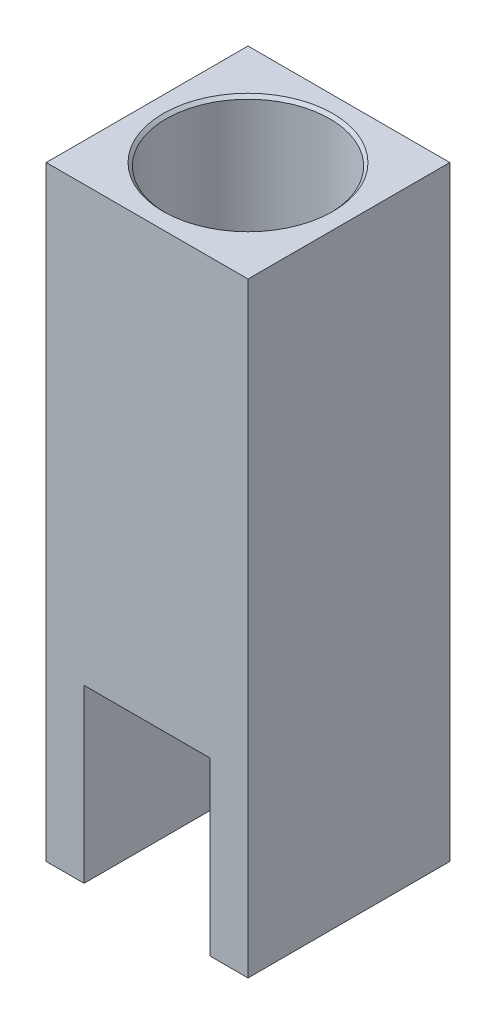
ISO-10303-21;
HEADER;
FILE_DESCRIPTION(('STEP AP214'),'2;1');
FILE_NAME('part.step','',(''),(''),'','','');
FILE_SCHEMA(('AUTOMOTIVE_DESIGN { 1 0 10303 214 1 1 1 1 }'));
ENDSEC;
DATA;
#1=APPLICATION_CONTEXT('core data for automotive mechanical design processes');
#2=APPLICATION_PROTOCOL_DEFINITION('international standard','automotive_design',2000,#1);
#3=PRODUCT_CONTEXT('',#1,'mechanical');
#4=PRODUCT('Part','Part','',(#3));
#5=PRODUCT_RELATED_PRODUCT_CATEGORY('part','',(#4));
#6=PRODUCT_DEFINITION_FORMATION('','',#4);
#7=PRODUCT_DEFINITION_CONTEXT('part definition',#1,'design');
#8=PRODUCT_DEFINITION('design','',#6,#7);
#9=PRODUCT_DEFINITION_SHAPE('','',#8);
#10=(LENGTH_UNIT() NAMED_UNIT(*) SI_UNIT(.MILLI.,.METRE.));
#11=(NAMED_UNIT(*) PLANE_ANGLE_UNIT() SI_UNIT($,.RADIAN.));
#12=(NAMED_UNIT(*) SI_UNIT($,.STERADIAN.) SOLID_ANGLE_UNIT());
#13=UNCERTAINTY_MEASURE_WITH_UNIT(LENGTH_MEASURE(1.E-05),#10,'distance_accuracy_value','');
#14=(GEOMETRIC_REPRESENTATION_CONTEXT(3) GLOBAL_UNCERTAINTY_ASSIGNED_CONTEXT((#13)) GLOBAL_UNIT_ASSIGNED_CONTEXT((#10,
#11,#12)) REPRESENTATION_CONTEXT('',''));
#15=CARTESIAN_POINT('',(0.,0.,0.));
#16=DIRECTION('',(0.,0.,1.));
#17=DIRECTION('',(1.,0.,0.));
#18=AXIS2_PLACEMENT_3D('',#15,#16,#17);
#19=CARTESIAN_POINT('',(25.4,0.,25.4));
#20=DIRECTION('',(0.,1.,0.));
#21=DIRECTION('',(0.,0.,1.));
#22=AXIS2_PLACEMENT_3D('',#19,#20,#21);
#23=CYLINDRICAL_SURFACE('',#22,6.1468);
#24=CARTESIAN_POINT('',(25.4,69.85,25.4));
#25=DIRECTION('',(0.,1.,0.));
#26=DIRECTION('',(0.,0.,1.));
#27=AXIS2_PLACEMENT_3D('',#24,#25,#26);
#28=CIRCLE('',#27,6.1468);
#29=CARTESIAN_POINT('',(25.4,69.85,31.5468));
#30=VERTEX_POINT('',#29);
#31=EDGE_CURVE('E178',#30,#30,#28,.F.);
#32=ORIENTED_EDGE('',*,*,#31,.F.);
#33=EDGE_LOOP('',(#32));
#34=FACE_BOUND('',#33,.T.);
#35=CARTESIAN_POINT('',(25.4,47.498,25.4));
#36=DIRECTION('',(0.,-1.,0.));
#37=DIRECTION('',(0.,0.,-1.));
#38=AXIS2_PLACEMENT_3D('',#35,#36,#37);
#39=CIRCLE('',#38,6.1468);
#40=CARTESIAN_POINT('',(25.4,47.498,19.2532));
#41=VERTEX_POINT('',#40);
#42=EDGE_CURVE('E144',#41,#41,#39,.F.);
#43=ORIENTED_EDGE('',*,*,#42,.F.);
#44=EDGE_LOOP('',(#43));
#45=FACE_BOUND('',#44,.T.);
#46=ADVANCED_FACE('F38',(#34,#45),#23,.F.);
#47=CARTESIAN_POINT('',(0.,152.4,0.));
#48=DIRECTION('',(1.,0.,0.));
#49=DIRECTION('',(0.,0.,-1.));
#50=AXIS2_PLACEMENT_3D('',#47,#48,#49);
#51=PLANE('',#50);
#52=DIRECTION('',(0.,0.,1.));
#53=VECTOR('',#52,1.);
#54=CARTESIAN_POINT('',(0.,0.,0.));
#55=LINE('',#54,#53);
#56=CARTESIAN_POINT('',(0.,0.,0.));
#57=VERTEX_POINT('',#56);
#58=CARTESIAN_POINT('',(0.,0.,50.8));
#59=VERTEX_POINT('',#58);
#60=EDGE_CURVE('E177',#57,#59,#55,.T.);
#61=ORIENTED_EDGE('',*,*,#60,.T.);
#62=DIRECTION('',(0.,-1.,0.));
#63=VECTOR('',#62,1.);
#64=CARTESIAN_POINT('',(0.,152.4,50.8));
#65=LINE('',#64,#63);
#66=CARTESIAN_POINT('',(0.,152.4,50.8));
#67=VERTEX_POINT('',#66);
#68=EDGE_CURVE('E207',#67,#59,#65,.T.);
#69=ORIENTED_EDGE('',*,*,#68,.F.);
#70=DIRECTION('',(0.,0.,1.));
#71=VECTOR('',#70,1.);
#72=CARTESIAN_POINT('',(0.,152.4,0.));
#73=LINE('',#72,#71);
#74=CARTESIAN_POINT('',(0.,152.4,0.));
#75=VERTEX_POINT('',#74);
#76=EDGE_CURVE('E179',#75,#67,#73,.T.);
#77=ORIENTED_EDGE('',*,*,#76,.F.);
#78=DIRECTION('',(0.,-1.,0.));
#79=VECTOR('',#78,1.);
#80=CARTESIAN_POINT('',(0.,152.4,0.));
#81=LINE('',#80,#79);
#82=EDGE_CURVE('E189',#75,#57,#81,.T.);
#83=ORIENTED_EDGE('',*,*,#82,.T.);
#84=EDGE_LOOP('',(#61,#69,#77,#83));
#85=FACE_BOUND('',#84,.T.);
#86=ADVANCED_FACE('F245',(#85),#51,.F.);
#87=CARTESIAN_POINT('',(0.,152.4,50.8));
#88=DIRECTION('',(0.,0.,-1.));
#89=DIRECTION('',(-1.,0.,0.));
#90=AXIS2_PLACEMENT_3D('',#87,#88,#89);
#91=PLANE('',#90);
#92=DIRECTION('',(1.,0.,0.));
#93=VECTOR('',#92,1.);
#94=CARTESIAN_POINT('',(0.,0.,50.8));
#95=LINE('',#94,#93);
#96=CARTESIAN_POINT('',(9.52500000000001,0.,50.8));
#97=VERTEX_POINT('',#96);
#98=EDGE_CURVE('E193',#59,#97,#95,.T.);
#99=ORIENTED_EDGE('',*,*,#98,.T.);
#100=DIRECTION('',(0.,-1.,0.));
#101=VECTOR('',#100,1.);
#102=CARTESIAN_POINT('',(9.52500000000001,0.,50.8));
#103=LINE('',#102,#101);
#104=CARTESIAN_POINT('',(9.52500000000001,43.18,50.8));
#105=VERTEX_POINT('',#104);
#106=EDGE_CURVE('E151',#105,#97,#103,.T.);
#107=ORIENTED_EDGE('',*,*,#106,.F.);
#108=DIRECTION('',(-1.,0.,0.));
#109=VECTOR('',#108,1.);
#110=CARTESIAN_POINT('',(9.52500000000001,43.18,50.8));
#111=LINE('',#110,#109);
#112=CARTESIAN_POINT('',(41.275,43.18,50.8));
#113=VERTEX_POINT('',#112);
#114=EDGE_CURVE('E158',#113,#105,#111,.T.);
#115=ORIENTED_EDGE('',*,*,#114,.F.);
#116=DIRECTION('',(0.,1.,0.));
#117=VECTOR('',#116,1.);
#118=CARTESIAN_POINT('',(41.275,43.18,50.8));
#119=LINE('',#118,#117);
#120=CARTESIAN_POINT('',(41.275,0.,50.8));
#121=VERTEX_POINT('',#120);
#122=EDGE_CURVE('E155',#121,#113,#119,.T.);
#123=ORIENTED_EDGE('',*,*,#122,.F.);
#124=CARTESIAN_POINT('',(50.8,0.,50.8));
#125=VERTEX_POINT('',#124);
#126=EDGE_CURVE('E192',#121,#125,#95,.T.);
#127=ORIENTED_EDGE('',*,*,#126,.T.);
#128=DIRECTION('',(0.,-1.,0.));
#129=VECTOR('',#128,1.);
#130=CARTESIAN_POINT('',(50.8,152.4,50.8));
#131=LINE('',#130,#129);
#132=CARTESIAN_POINT('',(50.8,152.4,50.8));
#133=VERTEX_POINT('',#132);
#134=EDGE_CURVE('E204',#133,#125,#131,.T.);
#135=ORIENTED_EDGE('',*,*,#134,.F.);
#136=DIRECTION('',(1.,0.,0.));
#137=VECTOR('',#136,1.);
#138=CARTESIAN_POINT('',(0.,152.4,50.8));
#139=LINE('',#138,#137);
#140=EDGE_CURVE('E182',#67,#133,#139,.T.);
#141=ORIENTED_EDGE('',*,*,#140,.F.);
#142=ORIENTED_EDGE('',*,*,#68,.T.);
#143=EDGE_LOOP('',(#99,#107,#115,#123,#127,#135,#141,#142));
#144=FACE_BOUND('',#143,.T.);
#145=ADVANCED_FACE('F251',(#144),#91,.F.);
#146=CARTESIAN_POINT('',(50.8,152.4,0.));
#147=DIRECTION('',(-1.,0.,0.));
#148=DIRECTION('',(0.,0.,1.));
#149=AXIS2_PLACEMENT_3D('',#146,#147,#148);
#150=PLANE('',#149);
#151=DIRECTION('',(0.,0.,-1.));
#152=VECTOR('',#151,1.);
#153=CARTESIAN_POINT('',(50.8,0.,0.));
#154=LINE('',#153,#152);
#155=CARTESIAN_POINT('',(50.8,0.,0.));
#156=VERTEX_POINT('',#155);
#157=EDGE_CURVE('E196',#125,#156,#154,.T.);
#158=ORIENTED_EDGE('',*,*,#157,.T.);
#159=DIRECTION('',(0.,-1.,0.));
#160=VECTOR('',#159,1.);
#161=CARTESIAN_POINT('',(50.8,152.4,0.));
#162=LINE('',#161,#160);
#163=CARTESIAN_POINT('',(50.8,152.4,0.));
#164=VERTEX_POINT('',#163);
#165=EDGE_CURVE('E201',#164,#156,#162,.T.);
#166=ORIENTED_EDGE('',*,*,#165,.F.);
#167=DIRECTION('',(0.,0.,-1.));
#168=VECTOR('',#167,1.);
#169=CARTESIAN_POINT('',(50.8,152.4,0.));
#170=LINE('',#169,#168);
#171=EDGE_CURVE('E185',#133,#164,#170,.T.);
#172=ORIENTED_EDGE('',*,*,#171,.F.);
#173=ORIENTED_EDGE('',*,*,#134,.T.);
#174=EDGE_LOOP('',(#158,#166,#172,#173));
#175=FACE_BOUND('',#174,.T.);
#176=ADVANCED_FACE('F271',(#175),#150,.F.);
#177=CARTESIAN_POINT('',(0.,152.4,0.));
#178=DIRECTION('',(0.,0.,1.));
#179=DIRECTION('',(1.,0.,0.));
#180=AXIS2_PLACEMENT_3D('',#177,#178,#179);
#181=PLANE('',#180);
#182=DIRECTION('',(-1.,0.,0.));
#183=VECTOR('',#182,1.);
#184=CARTESIAN_POINT('',(0.,0.,0.));
#185=LINE('',#184,#183);
#186=EDGE_CURVE('E183',#156,#57,#185,.T.);
#187=ORIENTED_EDGE('',*,*,#186,.T.);
#188=ORIENTED_EDGE('',*,*,#82,.F.);
#189=DIRECTION('',(-1.,0.,0.));
#190=VECTOR('',#189,1.);
#191=CARTESIAN_POINT('',(0.,152.4,0.));
#192=LINE('',#191,#190);
#193=EDGE_CURVE('E187',#164,#75,#192,.T.);
#194=ORIENTED_EDGE('',*,*,#193,.F.);
#195=ORIENTED_EDGE('',*,*,#165,.T.);
#196=EDGE_LOOP('',(#187,#188,#194,#195));
#197=FACE_BOUND('',#196,.T.);
#198=ADVANCED_FACE('F263',(#197),#181,.F.);
#199=CARTESIAN_POINT('',(0.,152.4,0.));
#200=DIRECTION('',(0.,1.,0.));
#201=DIRECTION('',(0.,0.,1.));
#202=AXIS2_PLACEMENT_3D('',#199,#200,#201);
#203=PLANE('',#202);
#204=CARTESIAN_POINT('',(25.4,152.4,25.4));
#205=DIRECTION('',(0.,1.,0.));
#206=DIRECTION('',(0.,0.,1.));
#207=AXIS2_PLACEMENT_3D('',#204,#205,#206);
#208=CIRCLE('',#207,21.3614);
#209=CARTESIAN_POINT('',(25.4,152.4,46.7614));
#210=VERTEX_POINT('',#209);
#211=EDGE_CURVE('E11',#210,#210,#208,.F.);
#212=ORIENTED_EDGE('',*,*,#211,.T.);
#213=EDGE_LOOP('',(#212));
#214=FACE_BOUND('',#213,.T.);
#215=ORIENTED_EDGE('',*,*,#76,.T.);
#216=ORIENTED_EDGE('',*,*,#140,.T.);
#217=ORIENTED_EDGE('',*,*,#171,.T.);
#218=ORIENTED_EDGE('',*,*,#193,.T.);
#219=EDGE_LOOP('',(#215,#216,#217,#218));
#220=FACE_BOUND('',#219,.T.);
#221=ADVANCED_FACE('F259',(#214,#220),#203,.T.);
#222=CARTESIAN_POINT('',(0.,0.,0.));
#223=DIRECTION('',(0.,1.,0.));
#224=DIRECTION('',(0.,0.,1.));
#225=AXIS2_PLACEMENT_3D('',#222,#223,#224);
#226=PLANE('',#225);
#227=CARTESIAN_POINT('',(6.35,0.,6.35));
#228=DIRECTION('',(0.,-1.,0.));
#229=DIRECTION('',(0.,0.,-1.));
#230=AXIS2_PLACEMENT_3D('',#227,#228,#229);
#231=CIRCLE('',#230,1.89864999999999);
#232=CARTESIAN_POINT('',(6.35,0.,4.45135000000001));
#233=VERTEX_POINT('',#232);
#234=EDGE_CURVE('E130',#233,#233,#231,.T.);
#235=ORIENTED_EDGE('',*,*,#234,.F.);
#236=EDGE_LOOP('',(#235));
#237=FACE_BOUND('',#236,.T.);
#238=CARTESIAN_POINT('',(44.45,0.,6.35000000000001));
#239=DIRECTION('',(0.,-1.,0.));
#240=DIRECTION('',(0.,0.,-1.));
#241=AXIS2_PLACEMENT_3D('',#238,#239,#240);
#242=CIRCLE('',#241,1.89864999999999);
#243=CARTESIAN_POINT('',(44.45,0.,4.45135000000002));
#244=VERTEX_POINT('',#243);
#245=EDGE_CURVE('E129',#244,#244,#242,.T.);
#246=ORIENTED_EDGE('',*,*,#245,.F.);
#247=EDGE_LOOP('',(#246));
#248=FACE_BOUND('',#247,.T.);
#249=DIRECTION('',(1.,0.,0.));
#250=VECTOR('',#249,1.);
#251=CARTESIAN_POINT('',(41.275,0.,8.3566));
#252=LINE('',#251,#250);
#253=CARTESIAN_POINT('',(15.875,0.,8.3566));
#254=VERTEX_POINT('',#253);
#255=CARTESIAN_POINT('',(34.925,0.,8.3566));
#256=VERTEX_POINT('',#255);
#257=EDGE_CURVE('E147',#254,#256,#252,.T.);
#258=ORIENTED_EDGE('',*,*,#257,.F.);
#259=CARTESIAN_POINT('',(15.875,0.,14.7066));
#260=DIRECTION('',(0.,1.,0.));
#261=DIRECTION('',(0.,0.,1.));
#262=AXIS2_PLACEMENT_3D('',#259,#260,#261);
#263=CIRCLE('',#262,6.35);
#264=CARTESIAN_POINT('',(9.52500000000001,0.,14.7066));
#265=VERTEX_POINT('',#264);
#266=EDGE_CURVE('E228',#254,#265,#263,.T.);
#267=ORIENTED_EDGE('',*,*,#266,.T.);
#268=DIRECTION('',(0.,0.,1.));
#269=VECTOR('',#268,1.);
#270=CARTESIAN_POINT('',(9.52500000000001,0.,8.3566));
#271=LINE('',#270,#269);
#272=EDGE_CURVE('E163',#265,#97,#271,.T.);
#273=ORIENTED_EDGE('',*,*,#272,.T.);
#274=ORIENTED_EDGE('',*,*,#98,.F.);
#275=ORIENTED_EDGE('',*,*,#60,.F.);
#276=ORIENTED_EDGE('',*,*,#186,.F.);
#277=ORIENTED_EDGE('',*,*,#157,.F.);
#278=ORIENTED_EDGE('',*,*,#126,.F.);
#279=DIRECTION('',(0.,0.,1.));
#280=VECTOR('',#279,1.);
#281=CARTESIAN_POINT('',(41.275,0.,8.3566));
#282=LINE('',#281,#280);
#283=CARTESIAN_POINT('',(41.275,0.,14.7066));
#284=VERTEX_POINT('',#283);
#285=EDGE_CURVE('E154',#284,#121,#282,.T.);
#286=ORIENTED_EDGE('',*,*,#285,.F.);
#287=CARTESIAN_POINT('',(34.925,0.,14.7066));
#288=DIRECTION('',(0.,1.,0.));
#289=DIRECTION('',(0.,0.,1.));
#290=AXIS2_PLACEMENT_3D('',#287,#288,#289);
#291=CIRCLE('',#290,6.35);
#292=EDGE_CURVE('E230',#284,#256,#291,.T.);
#293=ORIENTED_EDGE('',*,*,#292,.T.);
#294=EDGE_LOOP('',(#258,#267,#273,#274,#275,#276,#277,#278,#286,#293));
#295=FACE_BOUND('',#294,.T.);
#296=ADVANCED_FACE('F262',(#237,#248,#295),#226,.F.);
#297=CARTESIAN_POINT('',(25.4,77.47,25.4));
#298=DIRECTION('',(0.,1.,0.));
#299=DIRECTION('',(0.,0.,1.));
#300=AXIS2_PLACEMENT_3D('',#297,#298,#299);
#301=PLANE('',#300);
#302=CARTESIAN_POINT('',(25.4,77.47,25.4));
#303=DIRECTION('',(0.,1.,0.));
#304=DIRECTION('',(0.,0.,1.));
#305=AXIS2_PLACEMENT_3D('',#302,#303,#304);
#306=CIRCLE('',#305,17.78);
#307=CARTESIAN_POINT('',(25.4,77.47,43.18));
#308=VERTEX_POINT('',#307);
#309=EDGE_CURVE('E173',#308,#308,#306,.T.);
#310=ORIENTED_EDGE('',*,*,#309,.F.);
#311=EDGE_LOOP('',(#310));
#312=FACE_BOUND('',#311,.T.);
#313=CARTESIAN_POINT('',(25.4,77.47,25.4));
#314=DIRECTION('',(0.,1.,0.));
#315=DIRECTION('',(0.,0.,1.));
#316=AXIS2_PLACEMENT_3D('',#313,#314,#315);
#317=CIRCLE('',#316,20.5994);
#318=CARTESIAN_POINT('',(25.4,77.47,45.9994));
#319=VERTEX_POINT('',#318);
#320=EDGE_CURVE('E174',#319,#319,#317,.T.);
#321=ORIENTED_EDGE('',*,*,#320,.T.);
#322=EDGE_LOOP('',(#321));
#323=FACE_BOUND('',#322,.T.);
#324=ADVANCED_FACE('F267',(#312,#323),#301,.T.);
#325=CARTESIAN_POINT('',(25.4,77.47,25.4));
#326=DIRECTION('',(0.,1.,0.));
#327=DIRECTION('',(0.,0.,1.));
#328=AXIS2_PLACEMENT_3D('',#325,#326,#327);
#329=CYLINDRICAL_SURFACE('',#328,20.5994);
#330=CARTESIAN_POINT('',(25.4,151.638,25.4));
#331=DIRECTION('',(0.,1.,0.));
#332=DIRECTION('',(0.,0.,1.));
#333=AXIS2_PLACEMENT_3D('',#330,#331,#332);
#334=CIRCLE('',#333,20.5994);
#335=CARTESIAN_POINT('',(25.4,151.638,45.9994));
#336=VERTEX_POINT('',#335);
#337=EDGE_CURVE('E46',#336,#336,#334,.T.);
#338=ORIENTED_EDGE('',*,*,#337,.T.);
#339=EDGE_LOOP('',(#338));
#340=FACE_BOUND('',#339,.T.);
#341=ORIENTED_EDGE('',*,*,#320,.F.);
#342=EDGE_LOOP('',(#341));
#343=FACE_BOUND('',#342,.T.);
#344=ADVANCED_FACE('F234',(#340,#343),#329,.F.);
#345=CARTESIAN_POINT('',(25.4,69.85,25.4));
#346=DIRECTION('',(0.,1.,0.));
#347=DIRECTION('',(0.,0.,1.));
#348=AXIS2_PLACEMENT_3D('',#345,#346,#347);
#349=PLANE('',#348);
#350=CARTESIAN_POINT('',(25.4,69.85,25.4));
#351=DIRECTION('',(0.,1.,0.));
#352=DIRECTION('',(0.,0.,1.));
#353=AXIS2_PLACEMENT_3D('',#350,#351,#352);
#354=CIRCLE('',#353,17.78);
#355=CARTESIAN_POINT('',(25.4,69.85,43.18));
#356=VERTEX_POINT('',#355);
#357=EDGE_CURVE('E165',#356,#356,#354,.T.);
#358=ORIENTED_EDGE('',*,*,#357,.T.);
#359=EDGE_LOOP('',(#358));
#360=FACE_BOUND('',#359,.T.);
#361=ORIENTED_EDGE('',*,*,#31,.T.);
#362=EDGE_LOOP('',(#361));
#363=FACE_BOUND('',#362,.T.);
#364=ADVANCED_FACE('F330',(#360,#363),#349,.T.);
#365=CARTESIAN_POINT('',(25.4,69.85,25.4));
#366=DIRECTION('',(0.,1.,0.));
#367=DIRECTION('',(0.,0.,1.));
#368=AXIS2_PLACEMENT_3D('',#365,#366,#367);
#369=CYLINDRICAL_SURFACE('',#368,17.78);
#370=ORIENTED_EDGE('',*,*,#309,.T.);
#371=EDGE_LOOP('',(#370));
#372=FACE_BOUND('',#371,.T.);
#373=ORIENTED_EDGE('',*,*,#357,.F.);
#374=EDGE_LOOP('',(#373));
#375=FACE_BOUND('',#374,.T.);
#376=ADVANCED_FACE('F322',(#372,#375),#369,.F.);
#377=CARTESIAN_POINT('',(9.52500000000001,43.18,8.3566));
#378=DIRECTION('',(0.,1.,0.));
#379=DIRECTION('',(0.,0.,1.));
#380=AXIS2_PLACEMENT_3D('',#377,#378,#379);
#381=PLANE('',#380);
#382=CARTESIAN_POINT('',(25.4,43.18,25.4));
#383=DIRECTION('',(0.,-1.,0.));
#384=DIRECTION('',(0.,0.,-1.));
#385=AXIS2_PLACEMENT_3D('',#382,#383,#384);
#386=CIRCLE('',#385,9.144);
#387=CARTESIAN_POINT('',(25.4,43.18,16.256));
#388=VERTEX_POINT('',#387);
#389=EDGE_CURVE('E140',#388,#388,#386,.T.);
#390=ORIENTED_EDGE('',*,*,#389,.F.);
#391=EDGE_LOOP('',(#390));
#392=FACE_BOUND('',#391,.T.);
#393=DIRECTION('',(0.,0.,1.));
#394=VECTOR('',#393,1.);
#395=CARTESIAN_POINT('',(9.52500000000001,43.18,8.3566));
#396=LINE('',#395,#394);
#397=CARTESIAN_POINT('',(9.52500000000001,43.18,14.7066));
#398=VERTEX_POINT('',#397);
#399=EDGE_CURVE('E166',#398,#105,#396,.T.);
#400=ORIENTED_EDGE('',*,*,#399,.F.);
#401=CARTESIAN_POINT('',(15.875,43.18,14.7066));
#402=DIRECTION('',(0.,1.,0.));
#403=DIRECTION('',(0.,0.,1.));
#404=AXIS2_PLACEMENT_3D('',#401,#402,#403);
#405=CIRCLE('',#404,6.35);
#406=CARTESIAN_POINT('',(15.875,43.18,8.3566));
#407=VERTEX_POINT('',#406);
#408=EDGE_CURVE('E225',#398,#407,#405,.F.);
#409=ORIENTED_EDGE('',*,*,#408,.T.);
#410=DIRECTION('',(-1.,0.,0.));
#411=VECTOR('',#410,1.);
#412=CARTESIAN_POINT('',(34.925,43.18,8.3566));
#413=LINE('',#412,#411);
#414=CARTESIAN_POINT('',(34.925,43.18,8.3566));
#415=VERTEX_POINT('',#414);
#416=EDGE_CURVE('E150',#415,#407,#413,.T.);
#417=ORIENTED_EDGE('',*,*,#416,.F.);
#418=CARTESIAN_POINT('',(34.925,43.18,14.7066));
#419=DIRECTION('',(0.,1.,0.));
#420=DIRECTION('',(0.,0.,1.));
#421=AXIS2_PLACEMENT_3D('',#418,#419,#420);
#422=CIRCLE('',#421,6.35);
#423=CARTESIAN_POINT('',(41.275,43.18,14.7066));
#424=VERTEX_POINT('',#423);
#425=EDGE_CURVE('E61',#415,#424,#422,.F.);
#426=ORIENTED_EDGE('',*,*,#425,.T.);
#427=DIRECTION('',(0.,0.,1.));
#428=VECTOR('',#427,1.);
#429=CARTESIAN_POINT('',(41.275,43.18,8.3566));
#430=LINE('',#429,#428);
#431=EDGE_CURVE('E168',#424,#113,#430,.T.);
#432=ORIENTED_EDGE('',*,*,#431,.T.);
#433=ORIENTED_EDGE('',*,*,#114,.T.);
#434=EDGE_LOOP('',(#400,#409,#417,#426,#432,#433));
#435=FACE_BOUND('',#434,.T.);
#436=ADVANCED_FACE('F320',(#392,#435),#381,.F.);
#437=CARTESIAN_POINT('',(9.52500000000001,0.,8.3566));
#438=DIRECTION('',(-1.,0.,0.));
#439=DIRECTION('',(0.,0.,1.));
#440=AXIS2_PLACEMENT_3D('',#437,#438,#439);
#441=PLANE('',#440);
#442=ORIENTED_EDGE('',*,*,#272,.F.);
#443=DIRECTION('',(0.,-1.,0.));
#444=VECTOR('',#443,1.);
#445=CARTESIAN_POINT('',(9.52500000000001,43.18,14.7066));
#446=LINE('',#445,#444);
#447=EDGE_CURVE('E222',#265,#398,#446,.F.);
#448=ORIENTED_EDGE('',*,*,#447,.T.);
#449=ORIENTED_EDGE('',*,*,#399,.T.);
#450=ORIENTED_EDGE('',*,*,#106,.T.);
#451=EDGE_LOOP('',(#442,#448,#449,#450));
#452=FACE_BOUND('',#451,.T.);
#453=ADVANCED_FACE('F304',(#452),#441,.F.);
#454=CARTESIAN_POINT('',(41.275,43.18,8.3566));
#455=DIRECTION('',(1.,0.,0.));
#456=DIRECTION('',(0.,0.,-1.));
#457=AXIS2_PLACEMENT_3D('',#454,#455,#456);
#458=PLANE('',#457);
#459=ORIENTED_EDGE('',*,*,#431,.F.);
#460=DIRECTION('',(0.,1.,0.));
#461=VECTOR('',#460,1.);
#462=CARTESIAN_POINT('',(41.275,0.,14.7066));
#463=LINE('',#462,#461);
#464=EDGE_CURVE('E53',#424,#284,#463,.F.);
#465=ORIENTED_EDGE('',*,*,#464,.T.);
#466=ORIENTED_EDGE('',*,*,#285,.T.);
#467=ORIENTED_EDGE('',*,*,#122,.T.);
#468=EDGE_LOOP('',(#459,#465,#466,#467));
#469=FACE_BOUND('',#468,.T.);
#470=ADVANCED_FACE('F319',(#469),#458,.F.);
#471=CARTESIAN_POINT('',(0.,0.,8.3566));
#472=DIRECTION('',(0.,0.,-1.));
#473=DIRECTION('',(-1.,0.,0.));
#474=AXIS2_PLACEMENT_3D('',#471,#472,#473);
#475=PLANE('',#474);
#476=ORIENTED_EDGE('',*,*,#416,.T.);
#477=DIRECTION('',(0.,-1.,0.));
#478=VECTOR('',#477,1.);
#479=CARTESIAN_POINT('',(15.875,0.,8.3566));
#480=LINE('',#479,#478);
#481=EDGE_CURVE('E219',#407,#254,#480,.T.);
#482=ORIENTED_EDGE('',*,*,#481,.T.);
#483=ORIENTED_EDGE('',*,*,#257,.T.);
#484=DIRECTION('',(0.,1.,0.));
#485=VECTOR('',#484,1.);
#486=CARTESIAN_POINT('',(34.925,43.18,8.3566));
#487=LINE('',#486,#485);
#488=EDGE_CURVE('E210',#256,#415,#487,.T.);
#489=ORIENTED_EDGE('',*,*,#488,.T.);
#490=EDGE_LOOP('',(#476,#482,#483,#489));
#491=FACE_BOUND('',#490,.T.);
#492=ADVANCED_FACE('F298',(#491),#475,.F.);
#493=CARTESIAN_POINT('',(25.4,47.498,25.4));
#494=DIRECTION('',(0.,-1.,0.));
#495=DIRECTION('',(0.,0.,-1.));
#496=AXIS2_PLACEMENT_3D('',#493,#494,#495);
#497=PLANE('',#496);
#498=CARTESIAN_POINT('',(25.4,47.498,25.4));
#499=DIRECTION('',(0.,-1.,0.));
#500=DIRECTION('',(0.,0.,-1.));
#501=AXIS2_PLACEMENT_3D('',#498,#499,#500);
#502=CIRCLE('',#501,9.144);
#503=CARTESIAN_POINT('',(25.4,47.498,16.256));
#504=VERTEX_POINT('',#503);
#505=EDGE_CURVE('E141',#504,#504,#502,.T.);
#506=ORIENTED_EDGE('',*,*,#505,.T.);
#507=EDGE_LOOP('',(#506));
#508=FACE_BOUND('',#507,.T.);
#509=ORIENTED_EDGE('',*,*,#42,.T.);
#510=EDGE_LOOP('',(#509));
#511=FACE_BOUND('',#510,.T.);
#512=ADVANCED_FACE('F382',(#508,#511),#497,.T.);
#513=CARTESIAN_POINT('',(25.4,47.498,25.4));
#514=DIRECTION('',(0.,-1.,0.));
#515=DIRECTION('',(0.,0.,-1.));
#516=AXIS2_PLACEMENT_3D('',#513,#514,#515);
#517=CYLINDRICAL_SURFACE('',#516,9.144);
#518=ORIENTED_EDGE('',*,*,#505,.F.);
#519=EDGE_LOOP('',(#518));
#520=FACE_BOUND('',#519,.T.);
#521=ORIENTED_EDGE('',*,*,#389,.T.);
#522=EDGE_LOOP('',(#521));
#523=FACE_BOUND('',#522,.T.);
#524=ADVANCED_FACE('F282',(#520,#523),#517,.F.);
#525=CARTESIAN_POINT('',(15.875,0.,14.7066));
#526=DIRECTION('',(0.,1.,0.));
#527=DIRECTION('',(0.,0.,1.));
#528=AXIS2_PLACEMENT_3D('',#525,#526,#527);
#529=CYLINDRICAL_SURFACE('',#528,6.35);
#530=ORIENTED_EDGE('',*,*,#408,.F.);
#531=ORIENTED_EDGE('',*,*,#447,.F.);
#532=ORIENTED_EDGE('',*,*,#266,.F.);
#533=ORIENTED_EDGE('',*,*,#481,.F.);
#534=EDGE_LOOP('',(#530,#531,#532,#533));
#535=FACE_BOUND('',#534,.T.);
#536=ADVANCED_FACE('F279',(#535),#529,.F.);
#537=CARTESIAN_POINT('',(34.925,0.,14.7066));
#538=DIRECTION('',(0.,-1.,0.));
#539=DIRECTION('',(0.,0.,-1.));
#540=AXIS2_PLACEMENT_3D('',#537,#538,#539);
#541=CYLINDRICAL_SURFACE('',#540,6.35);
#542=ORIENTED_EDGE('',*,*,#292,.F.);
#543=ORIENTED_EDGE('',*,*,#464,.F.);
#544=ORIENTED_EDGE('',*,*,#425,.F.);
#545=ORIENTED_EDGE('',*,*,#488,.F.);
#546=EDGE_LOOP('',(#542,#543,#544,#545));
#547=FACE_BOUND('',#546,.T.);
#548=ADVANCED_FACE('F281',(#547),#541,.F.);
#549=CARTESIAN_POINT('',(44.45,17.78,6.35000000000001));
#550=DIRECTION('',(0.,-1.,0.));
#551=DIRECTION('',(0.,0.,-1.));
#552=AXIS2_PLACEMENT_3D('',#549,#550,#551);
#553=CONICAL_SURFACE('',#552,1.89864999999999,1.02974425867665);
#554=CARTESIAN_POINT('',(44.45,18.9208240143167,6.35000000000001));
#555=VERTEX_POINT('',#554);
#556=VERTEX_LOOP('',#555);
#557=FACE_BOUND('',#556,.T.);
#558=CARTESIAN_POINT('',(44.45,17.78,6.35000000000001));
#559=DIRECTION('',(0.,-1.,0.));
#560=DIRECTION('',(0.,0.,-1.));
#561=AXIS2_PLACEMENT_3D('',#558,#559,#560);
#562=CIRCLE('',#561,1.89864999999999);
#563=CARTESIAN_POINT('',(44.45,17.78,4.45135000000001));
#564=VERTEX_POINT('',#563);
#565=EDGE_CURVE('E133',#564,#564,#562,.T.);
#566=ORIENTED_EDGE('',*,*,#565,.T.);
#567=EDGE_LOOP('',(#566));
#568=FACE_BOUND('',#567,.T.);
#569=ADVANCED_FACE('F285',(#557,#568),#553,.F.);
#570=CARTESIAN_POINT('',(44.45,0.,6.35000000000001));
#571=DIRECTION('',(0.,-1.,0.));
#572=DIRECTION('',(0.,0.,-1.));
#573=AXIS2_PLACEMENT_3D('',#570,#571,#572);
#574=CYLINDRICAL_SURFACE('',#573,1.89864999999999);
#575=ORIENTED_EDGE('',*,*,#565,.F.);
#576=EDGE_LOOP('',(#575));
#577=FACE_BOUND('',#576,.T.);
#578=ORIENTED_EDGE('',*,*,#245,.T.);
#579=EDGE_LOOP('',(#578));
#580=FACE_BOUND('',#579,.T.);
#581=ADVANCED_FACE('F123',(#577,#580),#574,.F.);
#582=CARTESIAN_POINT('',(6.35,17.78,6.35));
#583=DIRECTION('',(0.,-1.,0.));
#584=DIRECTION('',(0.,0.,-1.));
#585=AXIS2_PLACEMENT_3D('',#582,#583,#584);
#586=CONICAL_SURFACE('',#585,1.89865,1.02974425867665);
#587=CARTESIAN_POINT('',(6.35,18.9208240143167,6.35));
#588=VERTEX_POINT('',#587);
#589=VERTEX_LOOP('',#588);
#590=FACE_BOUND('',#589,.T.);
#591=CARTESIAN_POINT('',(6.35,17.78,6.35));
#592=DIRECTION('',(0.,-1.,0.));
#593=DIRECTION('',(0.,0.,-1.));
#594=AXIS2_PLACEMENT_3D('',#591,#592,#593);
#595=CIRCLE('',#594,1.89865);
#596=CARTESIAN_POINT('',(6.35,17.78,4.45135));
#597=VERTEX_POINT('',#596);
#598=EDGE_CURVE('E127',#597,#597,#595,.T.);
#599=ORIENTED_EDGE('',*,*,#598,.T.);
#600=EDGE_LOOP('',(#599));
#601=FACE_BOUND('',#600,.T.);
#602=ADVANCED_FACE('F119',(#590,#601),#586,.F.);
#603=CARTESIAN_POINT('',(6.35,0.,6.35));
#604=DIRECTION('',(0.,-1.,0.));
#605=DIRECTION('',(0.,0.,-1.));
#606=AXIS2_PLACEMENT_3D('',#603,#604,#605);
#607=CYLINDRICAL_SURFACE('',#606,1.89864999999999);
#608=ORIENTED_EDGE('',*,*,#598,.F.);
#609=EDGE_LOOP('',(#608));
#610=FACE_BOUND('',#609,.T.);
#611=ORIENTED_EDGE('',*,*,#234,.T.);
#612=EDGE_LOOP('',(#611));
#613=FACE_BOUND('',#612,.T.);
#614=ADVANCED_FACE('F122',(#610,#613),#607,.F.);
#615=CARTESIAN_POINT('',(25.4,151.638,25.4));
#616=DIRECTION('',(0.,1.,0.));
#617=DIRECTION('',(0.,0.,1.));
#618=AXIS2_PLACEMENT_3D('',#615,#616,#617);
#619=CONICAL_SURFACE('',#618,20.5994,0.785398163397471);
#620=ORIENTED_EDGE('',*,*,#211,.F.);
#621=EDGE_LOOP('',(#620));
#622=FACE_BOUND('',#621,.T.);
#623=ORIENTED_EDGE('',*,*,#337,.F.);
#624=EDGE_LOOP('',(#623));
#625=FACE_BOUND('',#624,.T.);
#626=ADVANCED_FACE('F40',(#622,#625),#619,.F.);
#627=CLOSED_SHELL('',(#46,#86,#145,#176,#198,#221,#296,#324,#344,#364,#376,#436,#453,#470,#492,
#512,#524,#536,#548,#569,#581,#602,#614,#626));
#628=MANIFOLD_SOLID_BREP('B2',#627);
#629=ADVANCED_BREP_SHAPE_REPRESENTATION('',(#18,#628),#14);
#630=SHAPE_DEFINITION_REPRESENTATION(#9,#629);
ENDSEC;
END-ISO-10303-21;
